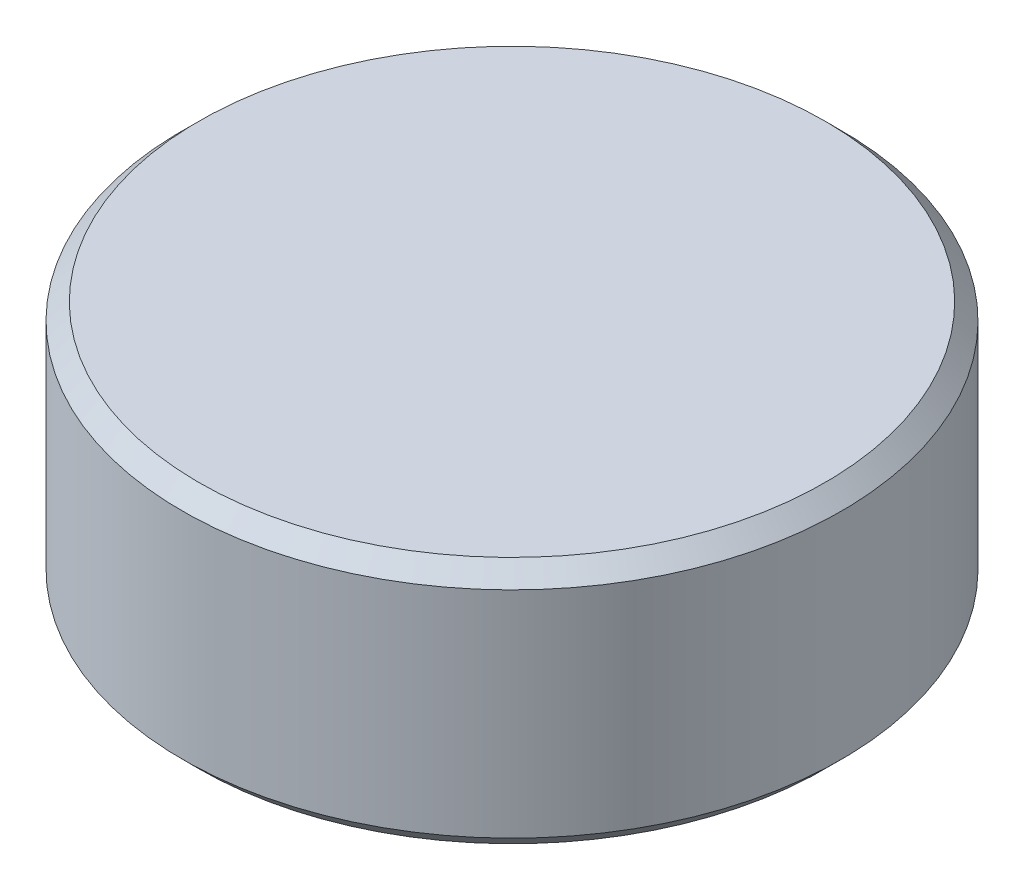
ISO-10303-21;
HEADER;
FILE_DESCRIPTION(('STEP AP214'),'2;1');
FILE_NAME('part.step','',(''),(''),'','','');
FILE_SCHEMA(('AUTOMOTIVE_DESIGN { 1 0 10303 214 1 1 1 1 }'));
ENDSEC;
DATA;
#1=APPLICATION_CONTEXT('core data for automotive mechanical design processes');
#2=APPLICATION_PROTOCOL_DEFINITION('international standard','automotive_design',2000,#1);
#3=PRODUCT_CONTEXT('',#1,'mechanical');
#4=PRODUCT('Part','Part','',(#3));
#5=PRODUCT_RELATED_PRODUCT_CATEGORY('part','',(#4));
#6=PRODUCT_DEFINITION_FORMATION('','',#4);
#7=PRODUCT_DEFINITION_CONTEXT('part definition',#1,'design');
#8=PRODUCT_DEFINITION('design','',#6,#7);
#9=PRODUCT_DEFINITION_SHAPE('','',#8);
#10=(LENGTH_UNIT() NAMED_UNIT(*) SI_UNIT(.MILLI.,.METRE.));
#11=(NAMED_UNIT(*) PLANE_ANGLE_UNIT() SI_UNIT($,.RADIAN.));
#12=(NAMED_UNIT(*) SI_UNIT($,.STERADIAN.) SOLID_ANGLE_UNIT());
#13=UNCERTAINTY_MEASURE_WITH_UNIT(LENGTH_MEASURE(1.E-05),#10,'distance_accuracy_value','');
#14=(GEOMETRIC_REPRESENTATION_CONTEXT(3) GLOBAL_UNCERTAINTY_ASSIGNED_CONTEXT((#13)) GLOBAL_UNIT_ASSIGNED_CONTEXT((#10,
#11,#12)) REPRESENTATION_CONTEXT('',''));
#15=CARTESIAN_POINT('',(0.,0.,0.));
#16=DIRECTION('',(0.,0.,1.));
#17=DIRECTION('',(1.,0.,0.));
#18=AXIS2_PLACEMENT_3D('',#15,#16,#17);
#19=CARTESIAN_POINT('',(0.,-18.125,705.55));
#20=DIRECTION('',(0.,1.,0.));
#21=DIRECTION('',(-0.0417220954268333,0.,0.999129254277541));
#22=AXIS2_PLACEMENT_3D('',#19,#20,#21);
#23=PLANE('',#22);
#24=CARTESIAN_POINT('',(0.,-18.125,705.55));
#25=DIRECTION('',(0.,-1.,0.));
#26=DIRECTION('',(-0.999129254277541,0.,-0.0417220954268332));
#27=AXIS2_PLACEMENT_3D('',#24,#25,#26);
#28=CIRCLE('',#27,38.);
#29=CARTESIAN_POINT('',(-37.9669116625466,-18.125,703.96456037378));
#30=VERTEX_POINT('',#29);
#31=EDGE_CURVE('E49',#30,#30,#28,.T.);
#32=ORIENTED_EDGE('',*,*,#31,.T.);
#33=EDGE_LOOP('',(#32));
#34=FACE_BOUND('',#33,.T.);
#35=ADVANCED_FACE('F17',(#34),#23,.F.);
#36=CARTESIAN_POINT('',(0.,11.975,705.55));
#37=DIRECTION('',(0.,1.,0.));
#38=DIRECTION('',(-0.0417220954268333,0.,0.999129254277541));
#39=AXIS2_PLACEMENT_3D('',#36,#37,#38);
#40=PLANE('',#39);
#41=CARTESIAN_POINT('',(0.,11.975,705.55));
#42=DIRECTION('',(0.,1.,0.));
#43=DIRECTION('',(-0.999129254277541,0.,-0.0417220954268332));
#44=AXIS2_PLACEMENT_3D('',#41,#42,#43);
#45=CIRCLE('',#44,38.);
#46=CARTESIAN_POINT('',(37.9669116625465,11.975,707.13543962622));
#47=VERTEX_POINT('',#46);
#48=EDGE_CURVE('E27',#47,#47,#45,.T.);
#49=ORIENTED_EDGE('',*,*,#48,.T.);
#50=EDGE_LOOP('',(#49));
#51=FACE_BOUND('',#50,.T.);
#52=ADVANCED_FACE('F63',(#51),#40,.T.);
#53=CARTESIAN_POINT('',(0.,11.975,705.55));
#54=DIRECTION('',(0.,-1.,0.));
#55=DIRECTION('',(0.999129254277541,0.,0.0417220954268332));
#56=AXIS2_PLACEMENT_3D('',#53,#54,#55);
#57=CYLINDRICAL_SURFACE('',#56,40.);
#58=CARTESIAN_POINT('',(0.,-16.125,705.55));
#59=DIRECTION('',(0.,1.,0.));
#60=DIRECTION('',(-0.999129254277541,0.,-0.0417220954268332));
#61=AXIS2_PLACEMENT_3D('',#58,#59,#60);
#62=CIRCLE('',#61,40.);
#63=CARTESIAN_POINT('',(-39.9651701711017,-16.125,703.881116182927));
#64=VERTEX_POINT('',#63);
#65=EDGE_CURVE('E52',#64,#64,#62,.T.);
#66=ORIENTED_EDGE('',*,*,#65,.T.);
#67=EDGE_LOOP('',(#66));
#68=FACE_BOUND('',#67,.T.);
#69=CARTESIAN_POINT('',(0.,9.975,705.55));
#70=DIRECTION('',(0.,-1.,0.));
#71=DIRECTION('',(-0.999129254277541,0.,-0.0417220954268332));
#72=AXIS2_PLACEMENT_3D('',#69,#70,#71);
#73=CIRCLE('',#72,40.);
#74=CARTESIAN_POINT('',(39.9651701711016,9.975,707.218883817073));
#75=VERTEX_POINT('',#74);
#76=EDGE_CURVE('E11',#75,#75,#73,.T.);
#77=ORIENTED_EDGE('',*,*,#76,.T.);
#78=EDGE_LOOP('',(#77));
#79=FACE_BOUND('',#78,.T.);
#80=ADVANCED_FACE('F67',(#68,#79),#57,.T.);
#81=CARTESIAN_POINT('',(0.,11.975,705.55));
#82=DIRECTION('',(0.,-1.,0.));
#83=DIRECTION('',(0.999129254277541,0.,0.0417220954268332));
#84=AXIS2_PLACEMENT_3D('',#81,#82,#83);
#85=CONICAL_SURFACE('',#84,38.,0.785398163397448);
#86=ORIENTED_EDGE('',*,*,#76,.F.);
#87=EDGE_LOOP('',(#86));
#88=FACE_BOUND('',#87,.T.);
#89=ORIENTED_EDGE('',*,*,#48,.F.);
#90=EDGE_LOOP('',(#89));
#91=FACE_BOUND('',#90,.T.);
#92=ADVANCED_FACE('F65',(#88,#91),#85,.T.);
#93=CARTESIAN_POINT('',(0.,-16.125,705.55));
#94=DIRECTION('',(0.,1.,0.));
#95=DIRECTION('',(-0.999129254277541,0.,-0.0417220954268332));
#96=AXIS2_PLACEMENT_3D('',#93,#94,#95);
#97=CONICAL_SURFACE('',#96,40.,0.785398163397448);
#98=ORIENTED_EDGE('',*,*,#65,.F.);
#99=EDGE_LOOP('',(#98));
#100=FACE_BOUND('',#99,.T.);
#101=ORIENTED_EDGE('',*,*,#31,.F.);
#102=EDGE_LOOP('',(#101));
#103=FACE_BOUND('',#102,.T.);
#104=ADVANCED_FACE('F19',(#100,#103),#97,.T.);
#105=CLOSED_SHELL('',(#35,#52,#80,#92,#104));
#106=MANIFOLD_SOLID_BREP('B1',#105);
#107=ADVANCED_BREP_SHAPE_REPRESENTATION('',(#18,#106),#14);
#108=SHAPE_DEFINITION_REPRESENTATION(#9,#107);
ENDSEC;
END-ISO-10303-21;
